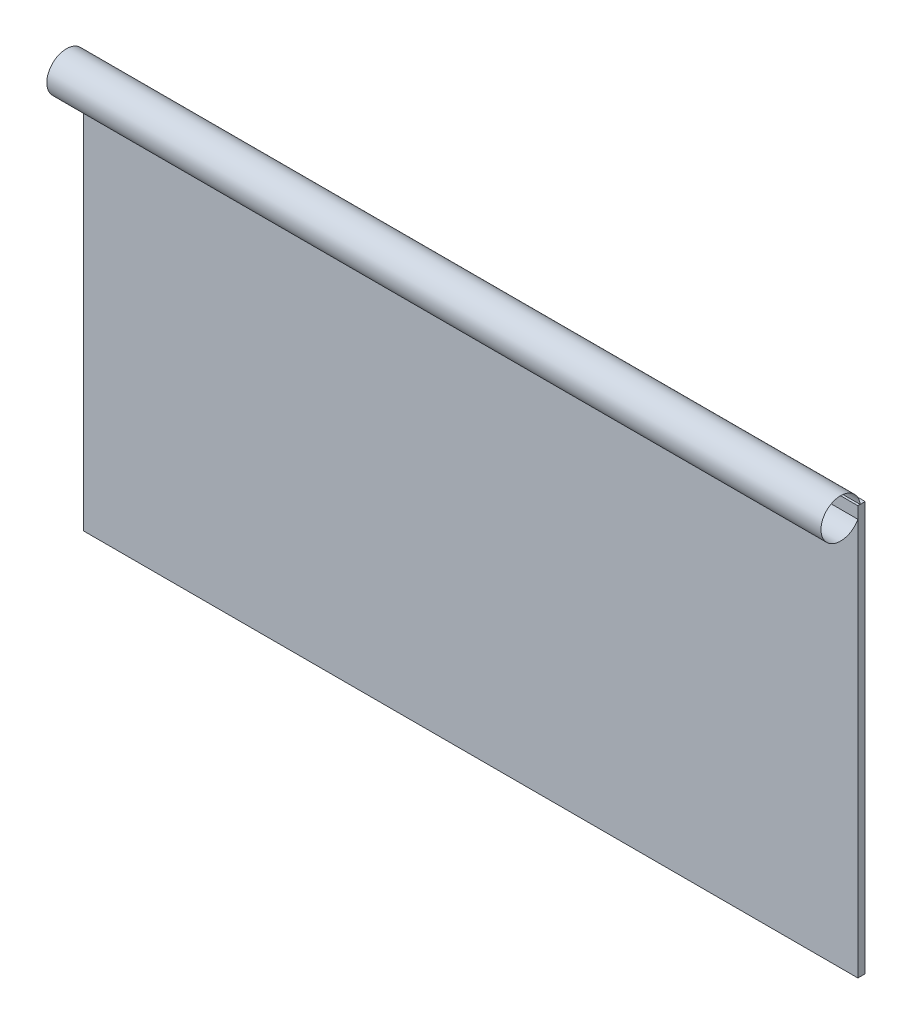
ISO-10303-21;
HEADER;
FILE_DESCRIPTION(('STEP AP214'),'2;1');
FILE_NAME('part.step','',(''),(''),'','','');
FILE_SCHEMA(('AUTOMOTIVE_DESIGN { 1 0 10303 214 1 1 1 1 }'));
ENDSEC;
DATA;
#1=APPLICATION_CONTEXT('core data for automotive mechanical design processes');
#2=APPLICATION_PROTOCOL_DEFINITION('international standard','automotive_design',2000,#1);
#3=PRODUCT_CONTEXT('',#1,'mechanical');
#4=PRODUCT('Part','Part','',(#3));
#5=PRODUCT_RELATED_PRODUCT_CATEGORY('part','',(#4));
#6=PRODUCT_DEFINITION_FORMATION('','',#4);
#7=PRODUCT_DEFINITION_CONTEXT('part definition',#1,'design');
#8=PRODUCT_DEFINITION('design','',#6,#7);
#9=PRODUCT_DEFINITION_SHAPE('','',#8);
#10=(LENGTH_UNIT() NAMED_UNIT(*) SI_UNIT(.MILLI.,.METRE.));
#11=(NAMED_UNIT(*) PLANE_ANGLE_UNIT() SI_UNIT($,.RADIAN.));
#12=(NAMED_UNIT(*) SI_UNIT($,.STERADIAN.) SOLID_ANGLE_UNIT());
#13=UNCERTAINTY_MEASURE_WITH_UNIT(LENGTH_MEASURE(1.E-05),#10,'distance_accuracy_value','');
#14=(GEOMETRIC_REPRESENTATION_CONTEXT(3) GLOBAL_UNCERTAINTY_ASSIGNED_CONTEXT((#13)) GLOBAL_UNIT_ASSIGNED_CONTEXT((#10,
#11,#12)) REPRESENTATION_CONTEXT('',''));
#15=CARTESIAN_POINT('',(0.,0.,0.));
#16=DIRECTION('',(0.,0.,1.));
#17=DIRECTION('',(1.,0.,0.));
#18=AXIS2_PLACEMENT_3D('',#15,#16,#17);
#19=CARTESIAN_POINT('',(106.,55.3681250053728,6.72202631255914));
#20=DIRECTION('',(-1.,0.,0.));
#21=DIRECTION('',(0.,0.,1.));
#22=AXIS2_PLACEMENT_3D('',#19,#20,#21);
#23=CYLINDRICAL_SURFACE('',#22,5.38347698396864);
#24=CARTESIAN_POINT('',(106.,55.3681250053728,6.72202631255914));
#25=DIRECTION('',(1.,0.,0.));
#26=DIRECTION('',(0.,0.,-1.));
#27=AXIS2_PLACEMENT_3D('',#24,#25,#26);
#28=CIRCLE('',#27,5.38347698396864);
#29=CARTESIAN_POINT('',(106.,55.3681250053728,1.3385493285905));
#30=VERTEX_POINT('',#29);
#31=EDGE_CURVE('E46',#30,#30,#28,.T.);
#32=ORIENTED_EDGE('',*,*,#31,.T.);
#33=EDGE_LOOP('',(#32));
#34=FACE_BOUND('',#33,.T.);
#35=CARTESIAN_POINT('',(-106.,55.3681250053728,6.72202631255914));
#36=DIRECTION('',(1.,0.,0.));
#37=DIRECTION('',(0.,0.,-1.));
#38=AXIS2_PLACEMENT_3D('',#35,#36,#37);
#39=CIRCLE('',#38,5.38347698396864);
#40=CARTESIAN_POINT('',(-106.,55.3681250053728,1.3385493285905));
#41=VERTEX_POINT('',#40);
#42=EDGE_CURVE('E11',#41,#41,#39,.T.);
#43=ORIENTED_EDGE('',*,*,#42,.F.);
#44=EDGE_LOOP('',(#43));
#45=FACE_BOUND('',#44,.T.);
#46=ADVANCED_FACE('F42',(#34,#45),#23,.F.);
#47=OPEN_SHELL('',(#46));
#48=SHELL_BASED_SURFACE_MODEL('B2',(#47));
#49=CARTESIAN_POINT('',(106.,-55.9999999999999,2.));
#50=DIRECTION('',(-1.,0.,0.));
#51=DIRECTION('',(0.,0.,1.));
#52=AXIS2_PLACEMENT_3D('',#49,#50,#51);
#53=PLANE('',#52);
#54=DIRECTION('',(0.,1.,0.));
#55=VECTOR('',#54,1.);
#56=CARTESIAN_POINT('',(106.,-55.9999999999999,0.));
#57=LINE('',#56,#55);
#58=CARTESIAN_POINT('',(106.,-55.9999999999999,0.));
#59=VERTEX_POINT('',#58);
#60=CARTESIAN_POINT('',(106.,56.,0.));
#61=VERTEX_POINT('',#60);
#62=EDGE_CURVE('E129',#59,#61,#57,.T.);
#63=ORIENTED_EDGE('',*,*,#62,.T.);
#64=DIRECTION('',(0.,0.,-1.));
#65=VECTOR('',#64,1.);
#66=CARTESIAN_POINT('',(106.,56.,2.));
#67=LINE('',#66,#65);
#68=CARTESIAN_POINT('',(106.,56.,2.));
#69=VERTEX_POINT('',#68);
#70=EDGE_CURVE('E40',#69,#61,#67,.T.);
#71=ORIENTED_EDGE('',*,*,#70,.F.);
#72=DIRECTION('',(0.,1.,0.));
#73=VECTOR('',#72,1.);
#74=CARTESIAN_POINT('',(106.,-55.9999999999999,2.));
#75=LINE('',#74,#73);
#76=CARTESIAN_POINT('',(106.,-55.9999999999999,2.));
#77=VERTEX_POINT('',#76);
#78=EDGE_CURVE('E117',#77,#69,#75,.T.);
#79=ORIENTED_EDGE('',*,*,#78,.F.);
#80=DIRECTION('',(0.,0.,-1.));
#81=VECTOR('',#80,1.);
#82=CARTESIAN_POINT('',(106.,-55.9999999999999,2.));
#83=LINE('',#82,#81);
#84=EDGE_CURVE('E125',#77,#59,#83,.T.);
#85=ORIENTED_EDGE('',*,*,#84,.T.);
#86=EDGE_LOOP('',(#63,#71,#79,#85));
#87=FACE_BOUND('',#86,.T.);
#88=ADVANCED_FACE('F66',(#87),#53,.F.);
#89=CARTESIAN_POINT('',(-106.,56.,2.));
#90=DIRECTION('',(0.,-1.,0.));
#91=DIRECTION('',(0.,0.,-1.));
#92=AXIS2_PLACEMENT_3D('',#89,#90,#91);
#93=PLANE('',#92);
#94=DIRECTION('',(-1.,0.,0.));
#95=VECTOR('',#94,1.);
#96=CARTESIAN_POINT('',(-106.,56.,0.));
#97=LINE('',#96,#95);
#98=CARTESIAN_POINT('',(-106.,56.,0.));
#99=VERTEX_POINT('',#98);
#100=EDGE_CURVE('E121',#61,#99,#97,.T.);
#101=ORIENTED_EDGE('',*,*,#100,.T.);
#102=DIRECTION('',(0.,0.,-1.));
#103=VECTOR('',#102,1.);
#104=CARTESIAN_POINT('',(-106.,56.,2.));
#105=LINE('',#104,#103);
#106=CARTESIAN_POINT('',(-106.,56.,2.));
#107=VERTEX_POINT('',#106);
#108=EDGE_CURVE('E74',#107,#99,#105,.T.);
#109=ORIENTED_EDGE('',*,*,#108,.F.);
#110=DIRECTION('',(-1.,0.,0.));
#111=VECTOR('',#110,1.);
#112=CARTESIAN_POINT('',(-106.,56.,2.));
#113=LINE('',#112,#111);
#114=EDGE_CURVE('E112',#69,#107,#113,.T.);
#115=ORIENTED_EDGE('',*,*,#114,.F.);
#116=ORIENTED_EDGE('',*,*,#70,.T.);
#117=EDGE_LOOP('',(#101,#109,#115,#116));
#118=FACE_BOUND('',#117,.T.);
#119=ADVANCED_FACE('F120',(#118),#93,.F.);
#120=CARTESIAN_POINT('',(-106.,-55.9999999999999,2.));
#121=DIRECTION('',(1.,0.,0.));
#122=DIRECTION('',(0.,0.,-1.));
#123=AXIS2_PLACEMENT_3D('',#120,#121,#122);
#124=PLANE('',#123);
#125=DIRECTION('',(0.,-1.,0.));
#126=VECTOR('',#125,1.);
#127=CARTESIAN_POINT('',(-106.,-55.9999999999999,0.));
#128=LINE('',#127,#126);
#129=CARTESIAN_POINT('',(-106.,-55.9999999999999,0.));
#130=VERTEX_POINT('',#129);
#131=EDGE_CURVE('E99',#99,#130,#128,.T.);
#132=ORIENTED_EDGE('',*,*,#131,.T.);
#133=DIRECTION('',(0.,0.,-1.));
#134=VECTOR('',#133,1.);
#135=CARTESIAN_POINT('',(-106.,-55.9999999999999,2.));
#136=LINE('',#135,#134);
#137=CARTESIAN_POINT('',(-106.,-55.9999999999999,2.));
#138=VERTEX_POINT('',#137);
#139=EDGE_CURVE('E122',#138,#130,#136,.T.);
#140=ORIENTED_EDGE('',*,*,#139,.F.);
#141=DIRECTION('',(0.,-1.,0.));
#142=VECTOR('',#141,1.);
#143=CARTESIAN_POINT('',(-106.,-55.9999999999999,2.));
#144=LINE('',#143,#142);
#145=EDGE_CURVE('E115',#107,#138,#144,.T.);
#146=ORIENTED_EDGE('',*,*,#145,.F.);
#147=ORIENTED_EDGE('',*,*,#108,.T.);
#148=EDGE_LOOP('',(#132,#140,#146,#147));
#149=FACE_BOUND('',#148,.T.);
#150=ADVANCED_FACE('F123',(#149),#124,.F.);
#151=CARTESIAN_POINT('',(-106.,-55.9999999999999,2.));
#152=DIRECTION('',(0.,1.,0.));
#153=DIRECTION('',(0.,0.,1.));
#154=AXIS2_PLACEMENT_3D('',#151,#152,#153);
#155=PLANE('',#154);
#156=DIRECTION('',(1.,0.,0.));
#157=VECTOR('',#156,1.);
#158=CARTESIAN_POINT('',(-106.,-55.9999999999999,0.));
#159=LINE('',#158,#157);
#160=EDGE_CURVE('E105',#130,#59,#159,.T.);
#161=ORIENTED_EDGE('',*,*,#160,.T.);
#162=ORIENTED_EDGE('',*,*,#84,.F.);
#163=DIRECTION('',(1.,0.,0.));
#164=VECTOR('',#163,1.);
#165=CARTESIAN_POINT('',(-106.,-55.9999999999999,2.));
#166=LINE('',#165,#164);
#167=EDGE_CURVE('E82',#138,#77,#166,.T.);
#168=ORIENTED_EDGE('',*,*,#167,.F.);
#169=ORIENTED_EDGE('',*,*,#139,.T.);
#170=EDGE_LOOP('',(#161,#162,#168,#169));
#171=FACE_BOUND('',#170,.T.);
#172=ADVANCED_FACE('F136',(#171),#155,.F.);
#173=CARTESIAN_POINT('',(0.,0.,2.));
#174=DIRECTION('',(0.,0.,-1.));
#175=DIRECTION('',(-1.,0.,0.));
#176=AXIS2_PLACEMENT_3D('',#173,#174,#175);
#177=PLANE('',#176);
#178=ORIENTED_EDGE('',*,*,#78,.T.);
#179=ORIENTED_EDGE('',*,*,#114,.T.);
#180=ORIENTED_EDGE('',*,*,#145,.T.);
#181=ORIENTED_EDGE('',*,*,#167,.T.);
#182=EDGE_LOOP('',(#178,#179,#180,#181));
#183=FACE_BOUND('',#182,.T.);
#184=ADVANCED_FACE('F113',(#183),#177,.F.);
#185=CARTESIAN_POINT('',(0.,0.,0.));
#186=DIRECTION('',(0.,0.,-1.));
#187=DIRECTION('',(-1.,0.,0.));
#188=AXIS2_PLACEMENT_3D('',#185,#186,#187);
#189=PLANE('',#188);
#190=ORIENTED_EDGE('',*,*,#62,.F.);
#191=ORIENTED_EDGE('',*,*,#160,.F.);
#192=ORIENTED_EDGE('',*,*,#131,.F.);
#193=ORIENTED_EDGE('',*,*,#100,.F.);
#194=EDGE_LOOP('',(#190,#191,#192,#193));
#195=FACE_BOUND('',#194,.T.);
#196=ADVANCED_FACE('F139',(#195),#189,.T.);
#197=CLOSED_SHELL('',(#88,#119,#150,#172,#184,#196));
#198=MANIFOLD_SOLID_BREP('B6',#197);
#199=ADVANCED_BREP_SHAPE_REPRESENTATION('',(#18,#198),#14);
#200=MANIFOLD_SURFACE_SHAPE_REPRESENTATION('',(#18,#48),#14);
#201=SHAPE_REPRESENTATION('',(#18),#14);
#202=SHAPE_DEFINITION_REPRESENTATION(#9,#201);
#203=SHAPE_REPRESENTATION_RELATIONSHIP('','',#201,#199);
#204=SHAPE_REPRESENTATION_RELATIONSHIP('','',#201,#200);
ENDSEC;
END-ISO-10303-21;
